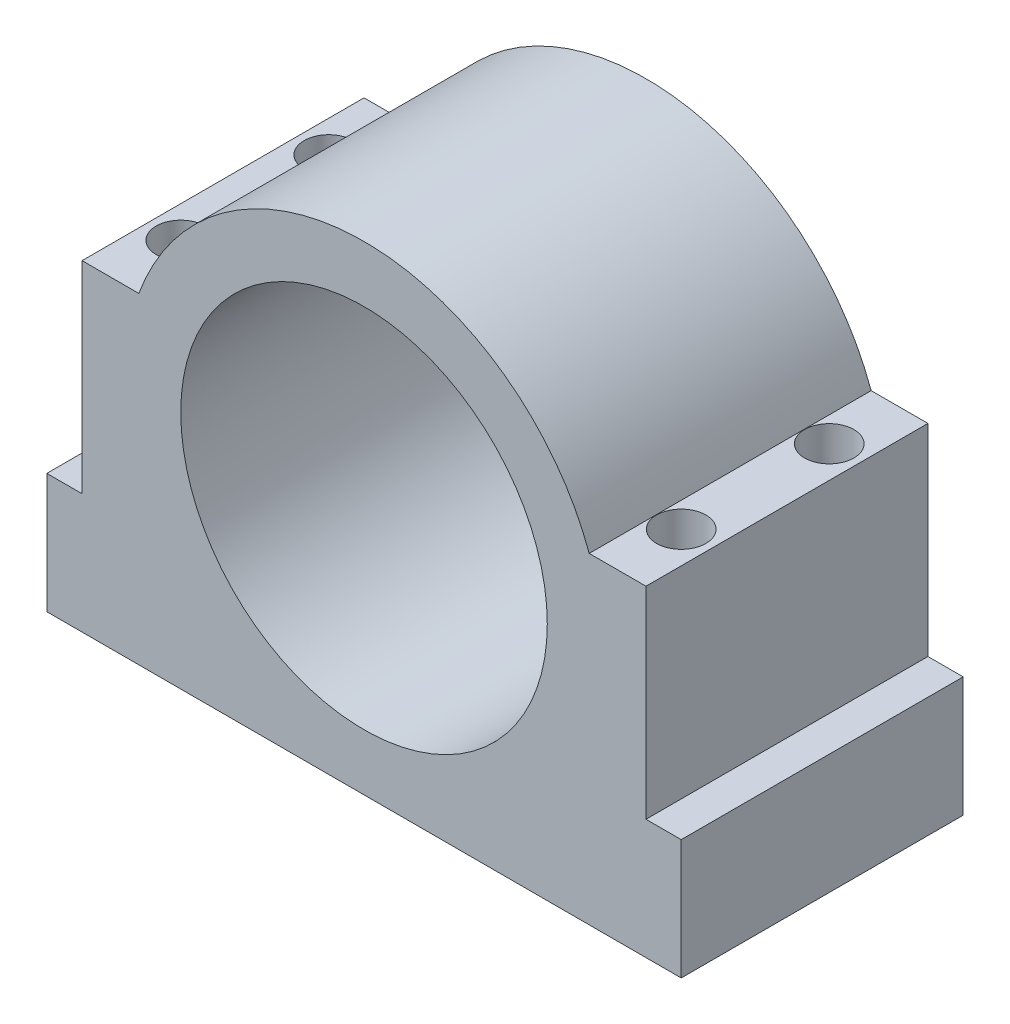
ISO-10303-21;
HEADER;
FILE_DESCRIPTION(('STEP AP214'),'2;1');
FILE_NAME('part.step','',(''),(''),'','','');
FILE_SCHEMA(('AUTOMOTIVE_DESIGN { 1 0 10303 214 1 1 1 1 }'));
ENDSEC;
DATA;
#1=APPLICATION_CONTEXT('core data for automotive mechanical design processes');
#2=APPLICATION_PROTOCOL_DEFINITION('international standard','automotive_design',2000,#1);
#3=PRODUCT_CONTEXT('',#1,'mechanical');
#4=PRODUCT('Part','Part','',(#3));
#5=PRODUCT_RELATED_PRODUCT_CATEGORY('part','',(#4));
#6=PRODUCT_DEFINITION_FORMATION('','',#4);
#7=PRODUCT_DEFINITION_CONTEXT('part definition',#1,'design');
#8=PRODUCT_DEFINITION('design','',#6,#7);
#9=PRODUCT_DEFINITION_SHAPE('','',#8);
#10=(LENGTH_UNIT() NAMED_UNIT(*) SI_UNIT(.MILLI.,.METRE.));
#11=(NAMED_UNIT(*) PLANE_ANGLE_UNIT() SI_UNIT($,.RADIAN.));
#12=(NAMED_UNIT(*) SI_UNIT($,.STERADIAN.) SOLID_ANGLE_UNIT());
#13=UNCERTAINTY_MEASURE_WITH_UNIT(LENGTH_MEASURE(1.E-05),#10,'distance_accuracy_value','');
#14=(GEOMETRIC_REPRESENTATION_CONTEXT(3) GLOBAL_UNCERTAINTY_ASSIGNED_CONTEXT((#13)) GLOBAL_UNIT_ASSIGNED_CONTEXT((#10,
#11,#12)) REPRESENTATION_CONTEXT('',''));
#15=CARTESIAN_POINT('',(0.,0.,0.));
#16=DIRECTION('',(0.,0.,1.));
#17=DIRECTION('',(1.,0.,0.));
#18=AXIS2_PLACEMENT_3D('',#15,#16,#17);
#19=CARTESIAN_POINT('',(0.,34.,40.));
#20=DIRECTION('',(0.,0.,1.));
#21=DIRECTION('',(1.,0.,0.));
#22=AXIS2_PLACEMENT_3D('',#19,#20,#21);
#23=PLANE('',#22);
#24=DIRECTION('',(0.,-1.,0.));
#25=VECTOR('',#24,1.);
#26=CARTESIAN_POINT('',(-45.,17.,40.));
#27=LINE('',#26,#25);
#28=CARTESIAN_POINT('',(-45.,17.,40.));
#29=VERTEX_POINT('',#28);
#30=CARTESIAN_POINT('',(-45.,0.,40.));
#31=VERTEX_POINT('',#30);
#32=EDGE_CURVE('E175',#29,#31,#27,.T.);
#33=ORIENTED_EDGE('',*,*,#32,.T.);
#34=DIRECTION('',(1.,0.,0.));
#35=VECTOR('',#34,1.);
#36=CARTESIAN_POINT('',(-45.,0.,40.));
#37=LINE('',#36,#35);
#38=CARTESIAN_POINT('',(45.,0.,40.));
#39=VERTEX_POINT('',#38);
#40=EDGE_CURVE('E113',#31,#39,#37,.T.);
#41=ORIENTED_EDGE('',*,*,#40,.T.);
#42=DIRECTION('',(0.,1.,0.));
#43=VECTOR('',#42,1.);
#44=CARTESIAN_POINT('',(45.,17.,40.));
#45=LINE('',#44,#43);
#46=CARTESIAN_POINT('',(45.,17.,40.));
#47=VERTEX_POINT('',#46);
#48=EDGE_CURVE('E222',#39,#47,#45,.T.);
#49=ORIENTED_EDGE('',*,*,#48,.T.);
#50=DIRECTION('',(-1.,0.,0.));
#51=VECTOR('',#50,1.);
#52=CARTESIAN_POINT('',(40.,17.,40.));
#53=LINE('',#52,#51);
#54=CARTESIAN_POINT('',(40.,17.,40.));
#55=VERTEX_POINT('',#54);
#56=EDGE_CURVE('E224',#47,#55,#53,.T.);
#57=ORIENTED_EDGE('',*,*,#56,.T.);
#58=DIRECTION('',(0.,1.,0.));
#59=VECTOR('',#58,1.);
#60=CARTESIAN_POINT('',(40.,17.,40.));
#61=LINE('',#60,#59);
#62=CARTESIAN_POINT('',(40.,45.6379069373572,40.));
#63=VERTEX_POINT('',#62);
#64=EDGE_CURVE('E226',#55,#63,#61,.T.);
#65=ORIENTED_EDGE('',*,*,#64,.T.);
#66=DIRECTION('',(-1.,0.,0.));
#67=VECTOR('',#66,1.);
#68=CARTESIAN_POINT('',(31.9461910423984,45.6379069373571,40.));
#69=LINE('',#68,#67);
#70=CARTESIAN_POINT('',(31.9461910423984,45.6379069373571,40.));
#71=VERTEX_POINT('',#70);
#72=EDGE_CURVE('E228',#63,#71,#69,.T.);
#73=ORIENTED_EDGE('',*,*,#72,.T.);
#74=CARTESIAN_POINT('',(0.,34.,40.));
#75=DIRECTION('',(0.,0.,1.));
#76=DIRECTION('',(1.,0.,0.));
#77=AXIS2_PLACEMENT_3D('',#74,#75,#76);
#78=CIRCLE('',#77,34.);
#79=CARTESIAN_POINT('',(-31.9461910423984,45.6379069373571,40.));
#80=VERTEX_POINT('',#79);
#81=EDGE_CURVE('E138',#71,#80,#78,.T.);
#82=ORIENTED_EDGE('',*,*,#81,.T.);
#83=DIRECTION('',(-1.,0.,0.));
#84=VECTOR('',#83,1.);
#85=CARTESIAN_POINT('',(-40.,45.6379069373571,40.));
#86=LINE('',#85,#84);
#87=CARTESIAN_POINT('',(-40.,45.6379069373571,40.));
#88=VERTEX_POINT('',#87);
#89=EDGE_CURVE('E132',#80,#88,#86,.T.);
#90=ORIENTED_EDGE('',*,*,#89,.T.);
#91=DIRECTION('',(0.,-1.,0.));
#92=VECTOR('',#91,1.);
#93=CARTESIAN_POINT('',(-40.,17.,40.));
#94=LINE('',#93,#92);
#95=CARTESIAN_POINT('',(-40.,17.,40.));
#96=VERTEX_POINT('',#95);
#97=EDGE_CURVE('E136',#88,#96,#94,.T.);
#98=ORIENTED_EDGE('',*,*,#97,.T.);
#99=DIRECTION('',(-1.,0.,0.));
#100=VECTOR('',#99,1.);
#101=CARTESIAN_POINT('',(-45.,17.,40.));
#102=LINE('',#101,#100);
#103=EDGE_CURVE('E64',#96,#29,#102,.T.);
#104=ORIENTED_EDGE('',*,*,#103,.T.);
#105=EDGE_LOOP('',(#33,#41,#49,#57,#65,#73,#82,#90,#98,#104));
#106=FACE_BOUND('',#105,.T.);
#107=CARTESIAN_POINT('',(0.,34.,40.));
#108=DIRECTION('',(0.,0.,1.));
#109=DIRECTION('',(1.,0.,0.));
#110=AXIS2_PLACEMENT_3D('',#107,#108,#109);
#111=CIRCLE('',#110,26.);
#112=CARTESIAN_POINT('',(26.,34.,40.));
#113=VERTEX_POINT('',#112);
#114=EDGE_CURVE('E160',#113,#113,#111,.T.);
#115=ORIENTED_EDGE('',*,*,#114,.F.);
#116=EDGE_LOOP('',(#115));
#117=FACE_BOUND('',#116,.T.);
#118=ADVANCED_FACE('F45',(#106,#117),#23,.T.);
#119=CARTESIAN_POINT('',(0.,34.,0.));
#120=DIRECTION('',(0.,0.,1.));
#121=DIRECTION('',(1.,0.,0.));
#122=AXIS2_PLACEMENT_3D('',#119,#120,#121);
#123=PLANE('',#122);
#124=DIRECTION('',(0.,-1.,0.));
#125=VECTOR('',#124,1.);
#126=CARTESIAN_POINT('',(-45.,17.,0.));
#127=LINE('',#126,#125);
#128=CARTESIAN_POINT('',(-45.,17.,0.));
#129=VERTEX_POINT('',#128);
#130=CARTESIAN_POINT('',(-45.,0.,0.));
#131=VERTEX_POINT('',#130);
#132=EDGE_CURVE('E156',#129,#131,#127,.T.);
#133=ORIENTED_EDGE('',*,*,#132,.F.);
#134=DIRECTION('',(-1.,0.,0.));
#135=VECTOR('',#134,1.);
#136=CARTESIAN_POINT('',(-45.,17.,0.));
#137=LINE('',#136,#135);
#138=CARTESIAN_POINT('',(-40.,17.,0.));
#139=VERTEX_POINT('',#138);
#140=EDGE_CURVE('E105',#139,#129,#137,.T.);
#141=ORIENTED_EDGE('',*,*,#140,.F.);
#142=DIRECTION('',(0.,-1.,0.));
#143=VECTOR('',#142,1.);
#144=CARTESIAN_POINT('',(-40.,17.,0.));
#145=LINE('',#144,#143);
#146=CARTESIAN_POINT('',(-40.,45.6379069373571,0.));
#147=VERTEX_POINT('',#146);
#148=EDGE_CURVE('E99',#147,#139,#145,.T.);
#149=ORIENTED_EDGE('',*,*,#148,.F.);
#150=DIRECTION('',(-1.,0.,0.));
#151=VECTOR('',#150,1.);
#152=CARTESIAN_POINT('',(-40.,45.6379069373571,0.));
#153=LINE('',#152,#151);
#154=CARTESIAN_POINT('',(-31.9461910423984,45.6379069373571,0.));
#155=VERTEX_POINT('',#154);
#156=EDGE_CURVE('E146',#155,#147,#153,.T.);
#157=ORIENTED_EDGE('',*,*,#156,.F.);
#158=CARTESIAN_POINT('',(0.,34.,0.));
#159=DIRECTION('',(0.,0.,1.));
#160=DIRECTION('',(1.,0.,0.));
#161=AXIS2_PLACEMENT_3D('',#158,#159,#160);
#162=CIRCLE('',#161,34.);
#163=CARTESIAN_POINT('',(31.9461910423984,45.6379069373571,0.));
#164=VERTEX_POINT('',#163);
#165=EDGE_CURVE('E170',#164,#155,#162,.T.);
#166=ORIENTED_EDGE('',*,*,#165,.F.);
#167=DIRECTION('',(-1.,0.,0.));
#168=VECTOR('',#167,1.);
#169=CARTESIAN_POINT('',(31.9461910423984,45.6379069373571,0.));
#170=LINE('',#169,#168);
#171=CARTESIAN_POINT('',(40.,45.6379069373572,0.));
#172=VERTEX_POINT('',#171);
#173=EDGE_CURVE('E168',#172,#164,#170,.T.);
#174=ORIENTED_EDGE('',*,*,#173,.F.);
#175=DIRECTION('',(0.,1.,0.));
#176=VECTOR('',#175,1.);
#177=CARTESIAN_POINT('',(40.,17.,0.));
#178=LINE('',#177,#176);
#179=CARTESIAN_POINT('',(40.,17.,0.));
#180=VERTEX_POINT('',#179);
#181=EDGE_CURVE('E166',#180,#172,#178,.T.);
#182=ORIENTED_EDGE('',*,*,#181,.F.);
#183=DIRECTION('',(-1.,0.,0.));
#184=VECTOR('',#183,1.);
#185=CARTESIAN_POINT('',(40.,17.,0.));
#186=LINE('',#185,#184);
#187=CARTESIAN_POINT('',(45.,17.,0.));
#188=VERTEX_POINT('',#187);
#189=EDGE_CURVE('E164',#188,#180,#186,.T.);
#190=ORIENTED_EDGE('',*,*,#189,.F.);
#191=DIRECTION('',(0.,1.,0.));
#192=VECTOR('',#191,1.);
#193=CARTESIAN_POINT('',(45.,17.,0.));
#194=LINE('',#193,#192);
#195=CARTESIAN_POINT('',(45.,0.,0.));
#196=VERTEX_POINT('',#195);
#197=EDGE_CURVE('E162',#196,#188,#194,.T.);
#198=ORIENTED_EDGE('',*,*,#197,.F.);
#199=DIRECTION('',(1.,0.,0.));
#200=VECTOR('',#199,1.);
#201=CARTESIAN_POINT('',(-45.,0.,0.));
#202=LINE('',#201,#200);
#203=EDGE_CURVE('E159',#131,#196,#202,.T.);
#204=ORIENTED_EDGE('',*,*,#203,.F.);
#205=EDGE_LOOP('',(#133,#141,#149,#157,#166,#174,#182,#190,#198,#204));
#206=FACE_BOUND('',#205,.T.);
#207=CARTESIAN_POINT('',(0.,34.,0.));
#208=DIRECTION('',(0.,0.,1.));
#209=DIRECTION('',(1.,0.,0.));
#210=AXIS2_PLACEMENT_3D('',#207,#208,#209);
#211=CIRCLE('',#210,26.);
#212=CARTESIAN_POINT('',(26.,34.,0.));
#213=VERTEX_POINT('',#212);
#214=EDGE_CURVE('E196',#213,#213,#211,.T.);
#215=ORIENTED_EDGE('',*,*,#214,.T.);
#216=EDGE_LOOP('',(#215));
#217=FACE_BOUND('',#216,.T.);
#218=ADVANCED_FACE('F241',(#206,#217),#123,.F.);
#219=CARTESIAN_POINT('',(-45.,17.,40.));
#220=DIRECTION('',(1.,0.,0.));
#221=DIRECTION('',(0.,0.,-1.));
#222=AXIS2_PLACEMENT_3D('',#219,#220,#221);
#223=PLANE('',#222);
#224=ORIENTED_EDGE('',*,*,#132,.T.);
#225=DIRECTION('',(0.,0.,-1.));
#226=VECTOR('',#225,1.);
#227=CARTESIAN_POINT('',(-45.,0.,40.));
#228=LINE('',#227,#226);
#229=EDGE_CURVE('E13',#31,#131,#228,.T.);
#230=ORIENTED_EDGE('',*,*,#229,.F.);
#231=ORIENTED_EDGE('',*,*,#32,.F.);
#232=DIRECTION('',(0.,0.,-1.));
#233=VECTOR('',#232,1.);
#234=CARTESIAN_POINT('',(-45.,17.,40.));
#235=LINE('',#234,#233);
#236=EDGE_CURVE('E152',#29,#129,#235,.T.);
#237=ORIENTED_EDGE('',*,*,#236,.T.);
#238=EDGE_LOOP('',(#224,#230,#231,#237));
#239=FACE_BOUND('',#238,.T.);
#240=ADVANCED_FACE('F47',(#239),#223,.F.);
#241=CARTESIAN_POINT('',(-45.,0.,40.));
#242=DIRECTION('',(0.,1.,0.));
#243=DIRECTION('',(-1.,0.,0.));
#244=AXIS2_PLACEMENT_3D('',#241,#242,#243);
#245=PLANE('',#244);
#246=CARTESIAN_POINT('',(-35.5,0.,9.5));
#247=DIRECTION('',(0.,-1.,0.));
#248=DIRECTION('',(-1.,0.,0.));
#249=AXIS2_PLACEMENT_3D('',#246,#247,#248);
#250=CIRCLE('',#249,3.49999999999999);
#251=CARTESIAN_POINT('',(-39.,0.,9.5));
#252=VERTEX_POINT('',#251);
#253=EDGE_CURVE('E201',#252,#252,#250,.T.);
#254=ORIENTED_EDGE('',*,*,#253,.F.);
#255=EDGE_LOOP('',(#254));
#256=FACE_BOUND('',#255,.T.);
#257=CARTESIAN_POINT('',(35.5,0.,30.5));
#258=DIRECTION('',(0.,-1.,0.));
#259=DIRECTION('',(-1.,0.,0.));
#260=AXIS2_PLACEMENT_3D('',#257,#258,#259);
#261=CIRCLE('',#260,3.5);
#262=CARTESIAN_POINT('',(32.,0.,30.5));
#263=VERTEX_POINT('',#262);
#264=EDGE_CURVE('E319',#263,#263,#261,.T.);
#265=ORIENTED_EDGE('',*,*,#264,.F.);
#266=EDGE_LOOP('',(#265));
#267=FACE_BOUND('',#266,.T.);
#268=CARTESIAN_POINT('',(35.5,0.,9.50000000000005));
#269=DIRECTION('',(0.,-1.,0.));
#270=DIRECTION('',(1.,0.,0.));
#271=AXIS2_PLACEMENT_3D('',#268,#269,#270);
#272=CIRCLE('',#271,3.5);
#273=CARTESIAN_POINT('',(39.,0.,9.50000000000005));
#274=VERTEX_POINT('',#273);
#275=EDGE_CURVE('E214',#274,#274,#272,.T.);
#276=ORIENTED_EDGE('',*,*,#275,.F.);
#277=EDGE_LOOP('',(#276));
#278=FACE_BOUND('',#277,.T.);
#279=CARTESIAN_POINT('',(-35.5,0.,30.5));
#280=DIRECTION('',(0.,-1.,0.));
#281=DIRECTION('',(1.,0.,0.));
#282=AXIS2_PLACEMENT_3D('',#279,#280,#281);
#283=CIRCLE('',#282,3.5);
#284=CARTESIAN_POINT('',(-32.,0.,30.5));
#285=VERTEX_POINT('',#284);
#286=EDGE_CURVE('E197',#285,#285,#283,.T.);
#287=ORIENTED_EDGE('',*,*,#286,.F.);
#288=EDGE_LOOP('',(#287));
#289=FACE_BOUND('',#288,.T.);
#290=ORIENTED_EDGE('',*,*,#203,.T.);
#291=DIRECTION('',(0.,0.,-1.));
#292=VECTOR('',#291,1.);
#293=CARTESIAN_POINT('',(45.,0.,40.));
#294=LINE('',#293,#292);
#295=EDGE_CURVE('E55',#39,#196,#294,.T.);
#296=ORIENTED_EDGE('',*,*,#295,.F.);
#297=ORIENTED_EDGE('',*,*,#40,.F.);
#298=ORIENTED_EDGE('',*,*,#229,.T.);
#299=EDGE_LOOP('',(#290,#296,#297,#298));
#300=FACE_BOUND('',#299,.T.);
#301=ADVANCED_FACE('F308',(#256,#267,#278,#289,#300),#245,.F.);
#302=CARTESIAN_POINT('',(45.,17.,40.));
#303=DIRECTION('',(-1.,0.,0.));
#304=DIRECTION('',(0.,0.,1.));
#305=AXIS2_PLACEMENT_3D('',#302,#303,#304);
#306=PLANE('',#305);
#307=ORIENTED_EDGE('',*,*,#197,.T.);
#308=DIRECTION('',(0.,0.,-1.));
#309=VECTOR('',#308,1.);
#310=CARTESIAN_POINT('',(45.,17.,40.));
#311=LINE('',#310,#309);
#312=EDGE_CURVE('E188',#47,#188,#311,.T.);
#313=ORIENTED_EDGE('',*,*,#312,.F.);
#314=ORIENTED_EDGE('',*,*,#48,.F.);
#315=ORIENTED_EDGE('',*,*,#295,.T.);
#316=EDGE_LOOP('',(#307,#313,#314,#315));
#317=FACE_BOUND('',#316,.T.);
#318=ADVANCED_FACE('F305',(#317),#306,.F.);
#319=CARTESIAN_POINT('',(40.,17.,40.));
#320=DIRECTION('',(0.,-1.,0.));
#321=DIRECTION('',(1.,0.,0.));
#322=AXIS2_PLACEMENT_3D('',#319,#320,#321);
#323=PLANE('',#322);
#324=ORIENTED_EDGE('',*,*,#189,.T.);
#325=DIRECTION('',(0.,0.,-1.));
#326=VECTOR('',#325,1.);
#327=CARTESIAN_POINT('',(40.,17.,40.));
#328=LINE('',#327,#326);
#329=EDGE_CURVE('E185',#55,#180,#328,.T.);
#330=ORIENTED_EDGE('',*,*,#329,.F.);
#331=ORIENTED_EDGE('',*,*,#56,.F.);
#332=ORIENTED_EDGE('',*,*,#312,.T.);
#333=EDGE_LOOP('',(#324,#330,#331,#332));
#334=FACE_BOUND('',#333,.T.);
#335=ADVANCED_FACE('F301',(#334),#323,.F.);
#336=CARTESIAN_POINT('',(40.,17.,40.));
#337=DIRECTION('',(-1.,0.,0.));
#338=DIRECTION('',(0.,-1.,0.));
#339=AXIS2_PLACEMENT_3D('',#336,#337,#338);
#340=PLANE('',#339);
#341=ORIENTED_EDGE('',*,*,#181,.T.);
#342=DIRECTION('',(0.,0.,-1.));
#343=VECTOR('',#342,1.);
#344=CARTESIAN_POINT('',(40.,45.6379069373572,40.));
#345=LINE('',#344,#343);
#346=EDGE_CURVE('E182',#63,#172,#345,.T.);
#347=ORIENTED_EDGE('',*,*,#346,.F.);
#348=ORIENTED_EDGE('',*,*,#64,.F.);
#349=ORIENTED_EDGE('',*,*,#329,.T.);
#350=EDGE_LOOP('',(#341,#347,#348,#349));
#351=FACE_BOUND('',#350,.T.);
#352=ADVANCED_FACE('F298',(#351),#340,.F.);
#353=CARTESIAN_POINT('',(31.9461910423984,45.6379069373571,40.));
#354=DIRECTION('',(0.,-1.,0.));
#355=DIRECTION('',(1.,0.,0.));
#356=AXIS2_PLACEMENT_3D('',#353,#354,#355);
#357=PLANE('',#356);
#358=CARTESIAN_POINT('',(35.5,45.6379069373571,30.5));
#359=DIRECTION('',(0.,-1.,0.));
#360=DIRECTION('',(1.,0.,0.));
#361=AXIS2_PLACEMENT_3D('',#358,#359,#360);
#362=CIRCLE('',#361,3.5);
#363=CARTESIAN_POINT('',(39.,45.6379069373572,30.5));
#364=VERTEX_POINT('',#363);
#365=EDGE_CURVE('E49',#364,#364,#362,.T.);
#366=ORIENTED_EDGE('',*,*,#365,.T.);
#367=EDGE_LOOP('',(#366));
#368=FACE_BOUND('',#367,.T.);
#369=CARTESIAN_POINT('',(35.5,45.6379069373571,9.50000000000005));
#370=DIRECTION('',(0.,-1.,0.));
#371=DIRECTION('',(1.,0.,0.));
#372=AXIS2_PLACEMENT_3D('',#369,#370,#371);
#373=CIRCLE('',#372,3.5);
#374=CARTESIAN_POINT('',(39.,45.6379069373572,9.50000000000005));
#375=VERTEX_POINT('',#374);
#376=EDGE_CURVE('E200',#375,#375,#373,.T.);
#377=ORIENTED_EDGE('',*,*,#376,.T.);
#378=EDGE_LOOP('',(#377));
#379=FACE_BOUND('',#378,.T.);
#380=ORIENTED_EDGE('',*,*,#173,.T.);
#381=DIRECTION('',(0.,0.,-1.));
#382=VECTOR('',#381,1.);
#383=CARTESIAN_POINT('',(31.9461910423984,45.6379069373571,40.));
#384=LINE('',#383,#382);
#385=EDGE_CURVE('E179',#71,#164,#384,.T.);
#386=ORIENTED_EDGE('',*,*,#385,.F.);
#387=ORIENTED_EDGE('',*,*,#72,.F.);
#388=ORIENTED_EDGE('',*,*,#346,.T.);
#389=EDGE_LOOP('',(#380,#386,#387,#388));
#390=FACE_BOUND('',#389,.T.);
#391=ADVANCED_FACE('F234',(#368,#379,#390),#357,.F.);
#392=CARTESIAN_POINT('',(0.,34.,40.));
#393=DIRECTION('',(0.,0.,-1.));
#394=DIRECTION('',(-1.,0.,0.));
#395=AXIS2_PLACEMENT_3D('',#392,#393,#394);
#396=CYLINDRICAL_SURFACE('',#395,34.);
#397=ORIENTED_EDGE('',*,*,#165,.T.);
#398=DIRECTION('',(0.,0.,-1.));
#399=VECTOR('',#398,1.);
#400=CARTESIAN_POINT('',(-31.9461910423984,45.6379069373571,40.));
#401=LINE('',#400,#399);
#402=EDGE_CURVE('E147',#80,#155,#401,.T.);
#403=ORIENTED_EDGE('',*,*,#402,.F.);
#404=ORIENTED_EDGE('',*,*,#81,.F.);
#405=ORIENTED_EDGE('',*,*,#385,.T.);
#406=EDGE_LOOP('',(#397,#403,#404,#405));
#407=FACE_BOUND('',#406,.T.);
#408=ADVANCED_FACE('F238',(#407),#396,.T.);
#409=CARTESIAN_POINT('',(-40.,45.6379069373571,40.));
#410=DIRECTION('',(0.,-1.,0.));
#411=DIRECTION('',(0.,0.,-1.));
#412=AXIS2_PLACEMENT_3D('',#409,#410,#411);
#413=PLANE('',#412);
#414=CARTESIAN_POINT('',(-35.5,45.6379069373571,9.5));
#415=DIRECTION('',(0.,-1.,0.));
#416=DIRECTION('',(0.,0.,-1.));
#417=AXIS2_PLACEMENT_3D('',#414,#415,#416);
#418=CIRCLE('',#417,3.49999999999999);
#419=CARTESIAN_POINT('',(-35.5,45.6379069373571,6.00000000000001));
#420=VERTEX_POINT('',#419);
#421=EDGE_CURVE('E198',#420,#420,#418,.T.);
#422=ORIENTED_EDGE('',*,*,#421,.T.);
#423=EDGE_LOOP('',(#422));
#424=FACE_BOUND('',#423,.T.);
#425=CARTESIAN_POINT('',(-35.5,45.6379069373571,30.5));
#426=DIRECTION('',(0.,-1.,0.));
#427=DIRECTION('',(0.,0.,-1.));
#428=AXIS2_PLACEMENT_3D('',#425,#426,#427);
#429=CIRCLE('',#428,3.5);
#430=CARTESIAN_POINT('',(-35.5,45.6379069373571,27.));
#431=VERTEX_POINT('',#430);
#432=EDGE_CURVE('E193',#431,#431,#429,.T.);
#433=ORIENTED_EDGE('',*,*,#432,.T.);
#434=EDGE_LOOP('',(#433));
#435=FACE_BOUND('',#434,.T.);
#436=ORIENTED_EDGE('',*,*,#156,.T.);
#437=DIRECTION('',(0.,0.,-1.));
#438=VECTOR('',#437,1.);
#439=CARTESIAN_POINT('',(-40.,45.6379069373571,40.));
#440=LINE('',#439,#438);
#441=EDGE_CURVE('E143',#88,#147,#440,.T.);
#442=ORIENTED_EDGE('',*,*,#441,.F.);
#443=ORIENTED_EDGE('',*,*,#89,.F.);
#444=ORIENTED_EDGE('',*,*,#402,.T.);
#445=EDGE_LOOP('',(#436,#442,#443,#444));
#446=FACE_BOUND('',#445,.T.);
#447=ADVANCED_FACE('F144',(#424,#435,#446),#413,.F.);
#448=CARTESIAN_POINT('',(-40.,17.,40.));
#449=DIRECTION('',(1.,0.,0.));
#450=DIRECTION('',(0.,0.,-1.));
#451=AXIS2_PLACEMENT_3D('',#448,#449,#450);
#452=PLANE('',#451);
#453=ORIENTED_EDGE('',*,*,#148,.T.);
#454=DIRECTION('',(0.,0.,-1.));
#455=VECTOR('',#454,1.);
#456=CARTESIAN_POINT('',(-40.,17.,40.));
#457=LINE('',#456,#455);
#458=EDGE_CURVE('E148',#96,#139,#457,.T.);
#459=ORIENTED_EDGE('',*,*,#458,.F.);
#460=ORIENTED_EDGE('',*,*,#97,.F.);
#461=ORIENTED_EDGE('',*,*,#441,.T.);
#462=EDGE_LOOP('',(#453,#459,#460,#461));
#463=FACE_BOUND('',#462,.T.);
#464=ADVANCED_FACE('F150',(#463),#452,.F.);
#465=CARTESIAN_POINT('',(-45.,17.,40.));
#466=DIRECTION('',(0.,-1.,0.));
#467=DIRECTION('',(0.,0.,-1.));
#468=AXIS2_PLACEMENT_3D('',#465,#466,#467);
#469=PLANE('',#468);
#470=ORIENTED_EDGE('',*,*,#140,.T.);
#471=ORIENTED_EDGE('',*,*,#236,.F.);
#472=ORIENTED_EDGE('',*,*,#103,.F.);
#473=ORIENTED_EDGE('',*,*,#458,.T.);
#474=EDGE_LOOP('',(#470,#471,#472,#473));
#475=FACE_BOUND('',#474,.T.);
#476=ADVANCED_FACE('F247',(#475),#469,.F.);
#477=CARTESIAN_POINT('',(0.,34.,40.));
#478=DIRECTION('',(0.,0.,-1.));
#479=DIRECTION('',(-1.,0.,0.));
#480=AXIS2_PLACEMENT_3D('',#477,#478,#479);
#481=CYLINDRICAL_SURFACE('',#480,26.);
#482=ORIENTED_EDGE('',*,*,#114,.T.);
#483=EDGE_LOOP('',(#482));
#484=FACE_BOUND('',#483,.T.);
#485=ORIENTED_EDGE('',*,*,#214,.F.);
#486=EDGE_LOOP('',(#485));
#487=FACE_BOUND('',#486,.T.);
#488=ADVANCED_FACE('F249',(#484,#487),#481,.F.);
#489=CARTESIAN_POINT('',(-35.5,100.,30.5));
#490=DIRECTION('',(0.,-1.,0.));
#491=DIRECTION('',(1.,0.,0.));
#492=AXIS2_PLACEMENT_3D('',#489,#490,#491);
#493=CYLINDRICAL_SURFACE('',#492,3.5);
#494=ORIENTED_EDGE('',*,*,#286,.T.);
#495=EDGE_LOOP('',(#494));
#496=FACE_BOUND('',#495,.T.);
#497=ORIENTED_EDGE('',*,*,#432,.F.);
#498=EDGE_LOOP('',(#497));
#499=FACE_BOUND('',#498,.T.);
#500=ADVANCED_FACE('F255',(#496,#499),#493,.F.);
#501=CARTESIAN_POINT('',(-35.5,100.,9.5));
#502=DIRECTION('',(0.,-1.,0.));
#503=DIRECTION('',(1.,0.,0.));
#504=AXIS2_PLACEMENT_3D('',#501,#502,#503);
#505=CYLINDRICAL_SURFACE('',#504,3.49999999999999);
#506=ORIENTED_EDGE('',*,*,#253,.T.);
#507=EDGE_LOOP('',(#506));
#508=FACE_BOUND('',#507,.T.);
#509=ORIENTED_EDGE('',*,*,#421,.F.);
#510=EDGE_LOOP('',(#509));
#511=FACE_BOUND('',#510,.T.);
#512=ADVANCED_FACE('F268',(#508,#511),#505,.F.);
#513=CARTESIAN_POINT('',(35.5,100.,9.50000000000005));
#514=DIRECTION('',(0.,-1.,0.));
#515=DIRECTION('',(1.,0.,0.));
#516=AXIS2_PLACEMENT_3D('',#513,#514,#515);
#517=CYLINDRICAL_SURFACE('',#516,3.5);
#518=ORIENTED_EDGE('',*,*,#275,.T.);
#519=EDGE_LOOP('',(#518));
#520=FACE_BOUND('',#519,.T.);
#521=ORIENTED_EDGE('',*,*,#376,.F.);
#522=EDGE_LOOP('',(#521));
#523=FACE_BOUND('',#522,.T.);
#524=ADVANCED_FACE('F269',(#520,#523),#517,.F.);
#525=CARTESIAN_POINT('',(35.5,100.,30.5));
#526=DIRECTION('',(0.,-1.,0.));
#527=DIRECTION('',(1.,0.,0.));
#528=AXIS2_PLACEMENT_3D('',#525,#526,#527);
#529=CYLINDRICAL_SURFACE('',#528,3.5);
#530=ORIENTED_EDGE('',*,*,#264,.T.);
#531=EDGE_LOOP('',(#530));
#532=FACE_BOUND('',#531,.T.);
#533=ORIENTED_EDGE('',*,*,#365,.F.);
#534=EDGE_LOOP('',(#533));
#535=FACE_BOUND('',#534,.T.);
#536=ADVANCED_FACE('F272',(#532,#535),#529,.F.);
#537=CLOSED_SHELL('',(#118,#218,#240,#301,#318,#335,#352,#391,#408,#447,#464,#476,#488,#500,
#512,#524,#536));
#538=MANIFOLD_SOLID_BREP('B2',#537);
#539=ADVANCED_BREP_SHAPE_REPRESENTATION('',(#18,#538),#14);
#540=SHAPE_DEFINITION_REPRESENTATION(#9,#539);
ENDSEC;
END-ISO-10303-21;
